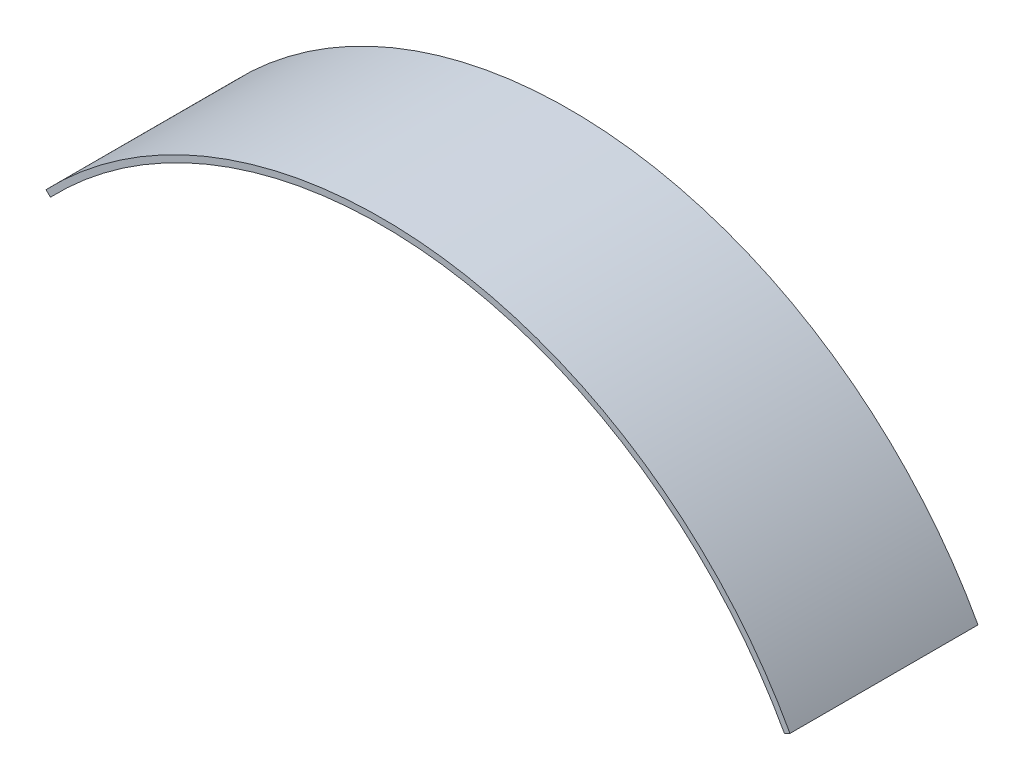
ISO-10303-21;
HEADER;
FILE_DESCRIPTION(('STEP AP214'),'2;1');
FILE_NAME('part.step','',(''),(''),'','','');
FILE_SCHEMA(('AUTOMOTIVE_DESIGN { 1 0 10303 214 1 1 1 1 }'));
ENDSEC;
DATA;
#1=APPLICATION_CONTEXT('core data for automotive mechanical design processes');
#2=APPLICATION_PROTOCOL_DEFINITION('international standard','automotive_design',2000,#1);
#3=PRODUCT_CONTEXT('',#1,'mechanical');
#4=PRODUCT('Part','Part','',(#3));
#5=PRODUCT_RELATED_PRODUCT_CATEGORY('part','',(#4));
#6=PRODUCT_DEFINITION_FORMATION('','',#4);
#7=PRODUCT_DEFINITION_CONTEXT('part definition',#1,'design');
#8=PRODUCT_DEFINITION('design','',#6,#7);
#9=PRODUCT_DEFINITION_SHAPE('','',#8);
#10=(LENGTH_UNIT() NAMED_UNIT(*) SI_UNIT(.MILLI.,.METRE.));
#11=(NAMED_UNIT(*) PLANE_ANGLE_UNIT() SI_UNIT($,.RADIAN.));
#12=(NAMED_UNIT(*) SI_UNIT($,.STERADIAN.) SOLID_ANGLE_UNIT());
#13=UNCERTAINTY_MEASURE_WITH_UNIT(LENGTH_MEASURE(1.E-05),#10,'distance_accuracy_value','');
#14=(GEOMETRIC_REPRESENTATION_CONTEXT(3) GLOBAL_UNCERTAINTY_ASSIGNED_CONTEXT((#13)) GLOBAL_UNIT_ASSIGNED_CONTEXT((#10,
#11,#12)) REPRESENTATION_CONTEXT('',''));
#15=CARTESIAN_POINT('',(0.,0.,0.));
#16=DIRECTION('',(0.,0.,1.));
#17=DIRECTION('',(1.,0.,0.));
#18=AXIS2_PLACEMENT_3D('',#15,#16,#17);
#19=CARTESIAN_POINT('',(94.651925008532,-90.6742192402224,53.));
#20=DIRECTION('',(0.,0.,-1.));
#21=DIRECTION('',(-1.,0.,0.));
#22=AXIS2_PLACEMENT_3D('',#19,#20,#21);
#23=CYLINDRICAL_SURFACE('',#22,131.075554328962);
#24=CARTESIAN_POINT('',(94.651925008532,-90.6742192402224,0.));
#25=DIRECTION('',(0.,0.,1.));
#26=DIRECTION('',(-1.,0.,0.));
#27=AXIS2_PLACEMENT_3D('',#24,#25,#26);
#28=CIRCLE('',#27,131.075554328962);
#29=CARTESIAN_POINT('',(209.709928635654,-27.8852333909037,0.));
#30=VERTEX_POINT('',#29);
#31=CARTESIAN_POINT('',(0.,0.,0.));
#32=VERTEX_POINT('',#31);
#33=EDGE_CURVE('E114',#30,#32,#28,.T.);
#34=ORIENTED_EDGE('',*,*,#33,.T.);
#35=DIRECTION('',(0.,0.,-1.));
#36=VECTOR('',#35,1.);
#37=CARTESIAN_POINT('',(0.,0.,53.));
#38=LINE('',#37,#36);
#39=CARTESIAN_POINT('',(0.,0.,53.));
#40=VERTEX_POINT('',#39);
#41=EDGE_CURVE('E11',#40,#32,#38,.T.);
#42=ORIENTED_EDGE('',*,*,#41,.F.);
#43=CARTESIAN_POINT('',(94.651925008532,-90.6742192402224,53.));
#44=DIRECTION('',(0.,0.,1.));
#45=DIRECTION('',(-1.,0.,0.));
#46=AXIS2_PLACEMENT_3D('',#43,#44,#45);
#47=CIRCLE('',#46,131.075554328962);
#48=CARTESIAN_POINT('',(209.709928635654,-27.8852333909037,53.));
#49=VERTEX_POINT('',#48);
#50=EDGE_CURVE('E98',#49,#40,#47,.T.);
#51=ORIENTED_EDGE('',*,*,#50,.F.);
#52=DIRECTION('',(0.,0.,-1.));
#53=VECTOR('',#52,1.);
#54=CARTESIAN_POINT('',(209.709928635654,-27.8852333909037,53.));
#55=LINE('',#54,#53);
#56=EDGE_CURVE('E110',#49,#30,#55,.T.);
#57=ORIENTED_EDGE('',*,*,#56,.T.);
#58=EDGE_LOOP('',(#34,#42,#51,#57));
#59=FACE_BOUND('',#58,.T.);
#60=ADVANCED_FACE('F38',(#59),#23,.T.);
#61=CARTESIAN_POINT('',(0.,0.,53.));
#62=DIRECTION('',(0.691770633391001,0.722117297104711,0.));
#63=DIRECTION('',(-0.722117297104711,0.691770633391001,0.));
#64=AXIS2_PLACEMENT_3D('',#61,#62,#63);
#65=PLANE('',#64);
#66=DIRECTION('',(0.722117297104711,-0.691770633391001,0.));
#67=VECTOR('',#66,1.);
#68=CARTESIAN_POINT('',(0.,0.,0.));
#69=LINE('',#68,#67);
#70=CARTESIAN_POINT('',(1.26370526993322,-1.21059860843423,0.));
#71=VERTEX_POINT('',#70);
#72=EDGE_CURVE('E103',#32,#71,#69,.T.);
#73=ORIENTED_EDGE('',*,*,#72,.T.);
#74=DIRECTION('',(0.,0.,-1.));
#75=VECTOR('',#74,1.);
#76=CARTESIAN_POINT('',(1.26370526993322,-1.21059860843423,53.));
#77=LINE('',#76,#75);
#78=CARTESIAN_POINT('',(1.26370526993322,-1.21059860843423,53.));
#79=VERTEX_POINT('',#78);
#80=EDGE_CURVE('E47',#79,#71,#77,.T.);
#81=ORIENTED_EDGE('',*,*,#80,.F.);
#82=DIRECTION('',(0.722117297104711,-0.691770633391001,0.));
#83=VECTOR('',#82,1.);
#84=CARTESIAN_POINT('',(0.,0.,53.));
#85=LINE('',#84,#83);
#86=EDGE_CURVE('E93',#40,#79,#85,.T.);
#87=ORIENTED_EDGE('',*,*,#86,.F.);
#88=ORIENTED_EDGE('',*,*,#41,.T.);
#89=EDGE_LOOP('',(#73,#81,#87,#88));
#90=FACE_BOUND('',#89,.T.);
#91=ADVANCED_FACE('F102',(#90),#65,.F.);
#92=CARTESIAN_POINT('',(94.651925008532,-90.6742192402224,53.));
#93=DIRECTION('',(0.,0.,-1.));
#94=DIRECTION('',(-1.,0.,0.));
#95=AXIS2_PLACEMENT_3D('',#92,#93,#94);
#96=CYLINDRICAL_SURFACE('',#95,129.325554328962);
#97=CARTESIAN_POINT('',(94.651925008532,-90.6742192402224,0.));
#98=DIRECTION('',(0.,0.,-1.));
#99=DIRECTION('',(-1.,0.,0.));
#100=AXIS2_PLACEMENT_3D('',#97,#98,#99);
#101=CIRCLE('',#100,129.325554328962);
#102=CARTESIAN_POINT('',(208.173780210585,-28.7235340625953,0.));
#103=VERTEX_POINT('',#102);
#104=EDGE_CURVE('E78',#71,#103,#101,.T.);
#105=ORIENTED_EDGE('',*,*,#104,.T.);
#106=DIRECTION('',(0.,0.,-1.));
#107=VECTOR('',#106,1.);
#108=CARTESIAN_POINT('',(208.173780210585,-28.7235340625953,53.));
#109=LINE('',#108,#107);
#110=CARTESIAN_POINT('',(208.173780210585,-28.7235340625953,53.));
#111=VERTEX_POINT('',#110);
#112=EDGE_CURVE('E105',#111,#103,#109,.T.);
#113=ORIENTED_EDGE('',*,*,#112,.F.);
#114=CARTESIAN_POINT('',(94.651925008532,-90.6742192402224,53.));
#115=DIRECTION('',(0.,0.,-1.));
#116=DIRECTION('',(-1.,0.,0.));
#117=AXIS2_PLACEMENT_3D('',#114,#115,#116);
#118=CIRCLE('',#117,129.325554328962);
#119=EDGE_CURVE('E96',#79,#111,#118,.T.);
#120=ORIENTED_EDGE('',*,*,#119,.F.);
#121=ORIENTED_EDGE('',*,*,#80,.T.);
#122=EDGE_LOOP('',(#105,#113,#120,#121));
#123=FACE_BOUND('',#122,.T.);
#124=ADVANCED_FACE('F106',(#123),#96,.F.);
#125=CARTESIAN_POINT('',(209.709928635654,-27.8852333909037,53.));
#126=DIRECTION('',(-0.479028955252294,0.877799100039352,0.));
#127=DIRECTION('',(-0.877799100039352,-0.479028955252294,0.));
#128=AXIS2_PLACEMENT_3D('',#125,#126,#127);
#129=PLANE('',#128);
#130=DIRECTION('',(0.877799100039352,0.479028955252294,0.));
#131=VECTOR('',#130,1.);
#132=CARTESIAN_POINT('',(209.709928635654,-27.8852333909037,0.));
#133=LINE('',#132,#131);
#134=EDGE_CURVE('E84',#103,#30,#133,.T.);
#135=ORIENTED_EDGE('',*,*,#134,.T.);
#136=ORIENTED_EDGE('',*,*,#56,.F.);
#137=DIRECTION('',(0.877799100039352,0.479028955252294,0.));
#138=VECTOR('',#137,1.);
#139=CARTESIAN_POINT('',(209.709928635654,-27.8852333909037,53.));
#140=LINE('',#139,#138);
#141=EDGE_CURVE('E58',#111,#49,#140,.T.);
#142=ORIENTED_EDGE('',*,*,#141,.F.);
#143=ORIENTED_EDGE('',*,*,#112,.T.);
#144=EDGE_LOOP('',(#135,#136,#142,#143));
#145=FACE_BOUND('',#144,.T.);
#146=ADVANCED_FACE('F127',(#145),#129,.F.);
#147=CARTESIAN_POINT('',(94.651925008532,-90.6742192402224,53.));
#148=DIRECTION('',(0.,0.,-1.));
#149=DIRECTION('',(-1.,0.,0.));
#150=AXIS2_PLACEMENT_3D('',#147,#148,#149);
#151=PLANE('',#150);
#152=ORIENTED_EDGE('',*,*,#50,.T.);
#153=ORIENTED_EDGE('',*,*,#86,.T.);
#154=ORIENTED_EDGE('',*,*,#119,.T.);
#155=ORIENTED_EDGE('',*,*,#141,.T.);
#156=EDGE_LOOP('',(#152,#153,#154,#155));
#157=FACE_BOUND('',#156,.T.);
#158=ADVANCED_FACE('F94',(#157),#151,.F.);
#159=CARTESIAN_POINT('',(94.651925008532,-90.6742192402224,0.));
#160=DIRECTION('',(0.,0.,-1.));
#161=DIRECTION('',(-1.,0.,0.));
#162=AXIS2_PLACEMENT_3D('',#159,#160,#161);
#163=PLANE('',#162);
#164=ORIENTED_EDGE('',*,*,#33,.F.);
#165=ORIENTED_EDGE('',*,*,#134,.F.);
#166=ORIENTED_EDGE('',*,*,#104,.F.);
#167=ORIENTED_EDGE('',*,*,#72,.F.);
#168=EDGE_LOOP('',(#164,#165,#166,#167));
#169=FACE_BOUND('',#168,.T.);
#170=ADVANCED_FACE('F130',(#169),#163,.T.);
#171=CLOSED_SHELL('',(#60,#91,#124,#146,#158,#170));
#172=MANIFOLD_SOLID_BREP('B2',#171);
#173=ADVANCED_BREP_SHAPE_REPRESENTATION('',(#18,#172),#14);
#174=SHAPE_DEFINITION_REPRESENTATION(#9,#173);
ENDSEC;
END-ISO-10303-21;
